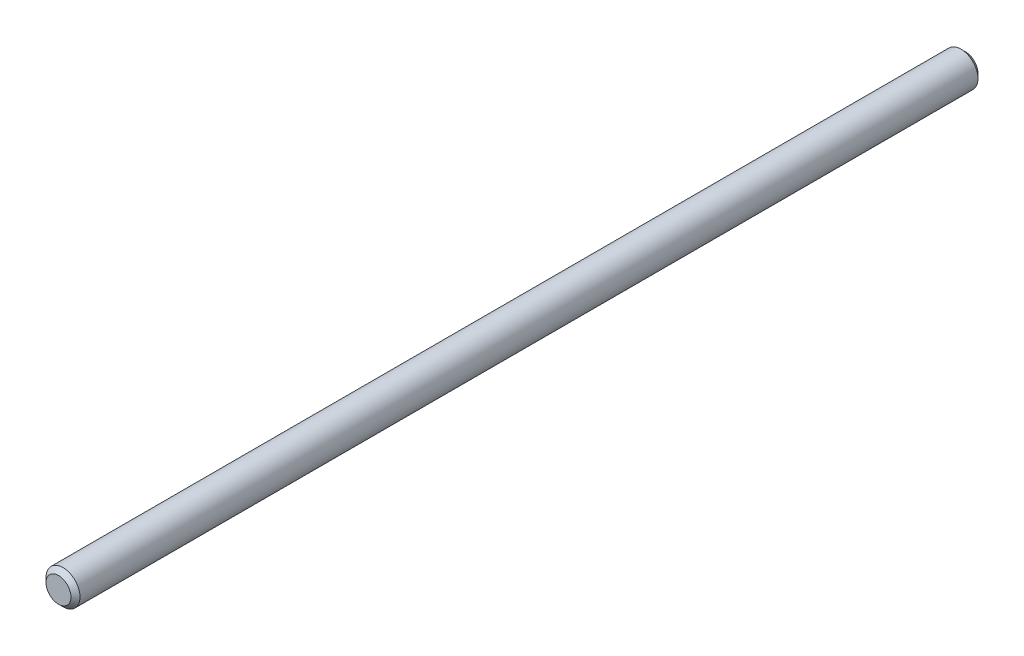
ISO-10303-21;
HEADER;
FILE_DESCRIPTION(('STEP AP214'),'2;1');
FILE_NAME('part.step','',(''),(''),'','','');
FILE_SCHEMA(('AUTOMOTIVE_DESIGN { 1 0 10303 214 1 1 1 1 }'));
ENDSEC;
DATA;
#1=APPLICATION_CONTEXT('core data for automotive mechanical design processes');
#2=APPLICATION_PROTOCOL_DEFINITION('international standard','automotive_design',2000,#1);
#3=PRODUCT_CONTEXT('',#1,'mechanical');
#4=PRODUCT('Part','Part','',(#3));
#5=PRODUCT_RELATED_PRODUCT_CATEGORY('part','',(#4));
#6=PRODUCT_DEFINITION_FORMATION('','',#4);
#7=PRODUCT_DEFINITION_CONTEXT('part definition',#1,'design');
#8=PRODUCT_DEFINITION('design','',#6,#7);
#9=PRODUCT_DEFINITION_SHAPE('','',#8);
#10=(LENGTH_UNIT() NAMED_UNIT(*) SI_UNIT(.MILLI.,.METRE.));
#11=(NAMED_UNIT(*) PLANE_ANGLE_UNIT() SI_UNIT($,.RADIAN.));
#12=(NAMED_UNIT(*) SI_UNIT($,.STERADIAN.) SOLID_ANGLE_UNIT());
#13=UNCERTAINTY_MEASURE_WITH_UNIT(LENGTH_MEASURE(1.E-05),#10,'distance_accuracy_value','');
#14=(GEOMETRIC_REPRESENTATION_CONTEXT(3) GLOBAL_UNCERTAINTY_ASSIGNED_CONTEXT((#13)) GLOBAL_UNIT_ASSIGNED_CONTEXT((#10,
#11,#12)) REPRESENTATION_CONTEXT('',''));
#15=CARTESIAN_POINT('',(0.,0.,0.));
#16=DIRECTION('',(0.,0.,1.));
#17=DIRECTION('',(1.,0.,0.));
#18=AXIS2_PLACEMENT_3D('',#15,#16,#17);
#19=CARTESIAN_POINT('',(0.,0.,400.));
#20=DIRECTION('',(0.,0.,-1.));
#21=DIRECTION('',(-1.,0.,0.));
#22=AXIS2_PLACEMENT_3D('',#19,#20,#21);
#23=CYLINDRICAL_SURFACE('',#22,7.5);
#24=CARTESIAN_POINT('',(0.,0.,398.));
#25=DIRECTION('',(0.,0.,1.));
#26=DIRECTION('',(1.,0.,0.));
#27=AXIS2_PLACEMENT_3D('',#24,#25,#26);
#28=CIRCLE('',#27,7.5);
#29=CARTESIAN_POINT('',(7.5,0.,398.));
#30=VERTEX_POINT('',#29);
#31=EDGE_CURVE('E48',#30,#30,#28,.F.);
#32=ORIENTED_EDGE('',*,*,#31,.T.);
#33=EDGE_LOOP('',(#32));
#34=FACE_BOUND('',#33,.T.);
#35=CARTESIAN_POINT('',(0.,0.,2.));
#36=DIRECTION('',(0.,0.,1.));
#37=DIRECTION('',(1.,0.,0.));
#38=AXIS2_PLACEMENT_3D('',#35,#36,#37);
#39=CIRCLE('',#38,7.5);
#40=CARTESIAN_POINT('',(7.5,0.,2.));
#41=VERTEX_POINT('',#40);
#42=EDGE_CURVE('E53',#41,#41,#39,.T.);
#43=ORIENTED_EDGE('',*,*,#42,.T.);
#44=EDGE_LOOP('',(#43));
#45=FACE_BOUND('',#44,.T.);
#46=ADVANCED_FACE('F39',(#34,#45),#23,.T.);
#47=CARTESIAN_POINT('',(0.,0.,400.));
#48=DIRECTION('',(0.,0.,1.));
#49=DIRECTION('',(1.,0.,0.));
#50=AXIS2_PLACEMENT_3D('',#47,#48,#49);
#51=PLANE('',#50);
#52=CARTESIAN_POINT('',(0.,0.,400.));
#53=DIRECTION('',(0.,0.,1.));
#54=DIRECTION('',(1.,0.,0.));
#55=AXIS2_PLACEMENT_3D('',#52,#53,#54);
#56=CIRCLE('',#55,5.50000000000012);
#57=CARTESIAN_POINT('',(5.50000000000012,0.,400.));
#58=VERTEX_POINT('',#57);
#59=EDGE_CURVE('E58',#58,#58,#56,.T.);
#60=ORIENTED_EDGE('',*,*,#59,.T.);
#61=EDGE_LOOP('',(#60));
#62=FACE_BOUND('',#61,.T.);
#63=ADVANCED_FACE('F65',(#62),#51,.T.);
#64=CARTESIAN_POINT('',(0.,0.,0.));
#65=DIRECTION('',(0.,0.,1.));
#66=DIRECTION('',(1.,0.,0.));
#67=AXIS2_PLACEMENT_3D('',#64,#65,#66);
#68=PLANE('',#67);
#69=CARTESIAN_POINT('',(0.,0.,0.));
#70=DIRECTION('',(0.,0.,1.));
#71=DIRECTION('',(1.,0.,0.));
#72=AXIS2_PLACEMENT_3D('',#69,#70,#71);
#73=CIRCLE('',#72,5.49999999999989);
#74=CARTESIAN_POINT('',(5.49999999999989,0.,0.));
#75=VERTEX_POINT('',#74);
#76=EDGE_CURVE('E10',#75,#75,#73,.F.);
#77=ORIENTED_EDGE('',*,*,#76,.T.);
#78=EDGE_LOOP('',(#77));
#79=FACE_BOUND('',#78,.T.);
#80=ADVANCED_FACE('F69',(#79),#68,.F.);
#81=CARTESIAN_POINT('',(0.,0.,400.));
#82=DIRECTION('',(0.,0.,-1.));
#83=DIRECTION('',(-1.,0.,0.));
#84=AXIS2_PLACEMENT_3D('',#81,#82,#83);
#85=CONICAL_SURFACE('',#84,5.50000000000012,0.785398163397447);
#86=ORIENTED_EDGE('',*,*,#31,.F.);
#87=EDGE_LOOP('',(#86));
#88=FACE_BOUND('',#87,.T.);
#89=ORIENTED_EDGE('',*,*,#59,.F.);
#90=EDGE_LOOP('',(#89));
#91=FACE_BOUND('',#90,.T.);
#92=ADVANCED_FACE('F67',(#88,#91),#85,.T.);
#93=CARTESIAN_POINT('',(0.,0.,2.));
#94=DIRECTION('',(0.,0.,1.));
#95=DIRECTION('',(1.,0.,0.));
#96=AXIS2_PLACEMENT_3D('',#93,#94,#95);
#97=CONICAL_SURFACE('',#96,7.5,0.785398163397474);
#98=ORIENTED_EDGE('',*,*,#76,.F.);
#99=EDGE_LOOP('',(#98));
#100=FACE_BOUND('',#99,.T.);
#101=ORIENTED_EDGE('',*,*,#42,.F.);
#102=EDGE_LOOP('',(#101));
#103=FACE_BOUND('',#102,.T.);
#104=ADVANCED_FACE('F42',(#100,#103),#97,.T.);
#105=CLOSED_SHELL('',(#46,#63,#80,#92,#104));
#106=MANIFOLD_SOLID_BREP('B2',#105);
#107=ADVANCED_BREP_SHAPE_REPRESENTATION('',(#18,#106),#14);
#108=SHAPE_DEFINITION_REPRESENTATION(#9,#107);
ENDSEC;
END-ISO-10303-21;
